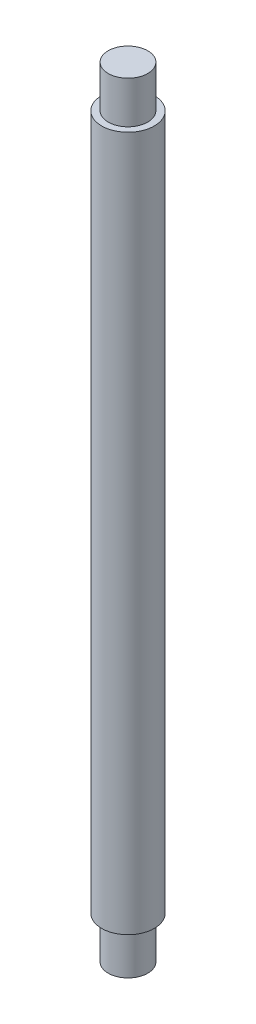
ISO-10303-21;
HEADER;
FILE_DESCRIPTION(('STEP AP214'),'2;1');
FILE_NAME('part.step','',(''),(''),'','','');
FILE_SCHEMA(('AUTOMOTIVE_DESIGN { 1 0 10303 214 1 1 1 1 }'));
ENDSEC;
DATA;
#1=APPLICATION_CONTEXT('core data for automotive mechanical design processes');
#2=APPLICATION_PROTOCOL_DEFINITION('international standard','automotive_design',2000,#1);
#3=PRODUCT_CONTEXT('',#1,'mechanical');
#4=PRODUCT('Part','Part','',(#3));
#5=PRODUCT_RELATED_PRODUCT_CATEGORY('part','',(#4));
#6=PRODUCT_DEFINITION_FORMATION('','',#4);
#7=PRODUCT_DEFINITION_CONTEXT('part definition',#1,'design');
#8=PRODUCT_DEFINITION('design','',#6,#7);
#9=PRODUCT_DEFINITION_SHAPE('','',#8);
#10=(LENGTH_UNIT() NAMED_UNIT(*) SI_UNIT(.MILLI.,.METRE.));
#11=(NAMED_UNIT(*) PLANE_ANGLE_UNIT() SI_UNIT($,.RADIAN.));
#12=(NAMED_UNIT(*) SI_UNIT($,.STERADIAN.) SOLID_ANGLE_UNIT());
#13=UNCERTAINTY_MEASURE_WITH_UNIT(LENGTH_MEASURE(1.E-05),#10,'distance_accuracy_value','');
#14=(GEOMETRIC_REPRESENTATION_CONTEXT(3) GLOBAL_UNCERTAINTY_ASSIGNED_CONTEXT((#13)) GLOBAL_UNIT_ASSIGNED_CONTEXT((#10,
#11,#12)) REPRESENTATION_CONTEXT('',''));
#15=CARTESIAN_POINT('',(0.,0.,0.));
#16=DIRECTION('',(0.,0.,1.));
#17=DIRECTION('',(1.,0.,0.));
#18=AXIS2_PLACEMENT_3D('',#15,#16,#17);
#19=CARTESIAN_POINT('',(0.,66.,0.));
#20=DIRECTION('',(0.,-1.,0.));
#21=DIRECTION('',(0.,0.,-1.));
#22=AXIS2_PLACEMENT_3D('',#19,#20,#21);
#23=CYLINDRICAL_SURFACE('',#22,2.5);
#24=CARTESIAN_POINT('',(0.,66.,0.));
#25=DIRECTION('',(0.,1.,0.));
#26=DIRECTION('',(0.,0.,1.));
#27=AXIS2_PLACEMENT_3D('',#24,#25,#26);
#28=CIRCLE('',#27,2.5);
#29=CARTESIAN_POINT('',(0.,66.,2.5));
#30=VERTEX_POINT('',#29);
#31=EDGE_CURVE('E47',#30,#30,#28,.T.);
#32=ORIENTED_EDGE('',*,*,#31,.F.);
#33=EDGE_LOOP('',(#32));
#34=FACE_BOUND('',#33,.T.);
#35=CARTESIAN_POINT('',(0.,0.,0.));
#36=DIRECTION('',(0.,1.,0.));
#37=DIRECTION('',(0.,0.,1.));
#38=AXIS2_PLACEMENT_3D('',#35,#36,#37);
#39=CIRCLE('',#38,2.5);
#40=CARTESIAN_POINT('',(0.,0.,2.5));
#41=VERTEX_POINT('',#40);
#42=EDGE_CURVE('E38',#41,#41,#39,.T.);
#43=ORIENTED_EDGE('',*,*,#42,.T.);
#44=EDGE_LOOP('',(#43));
#45=FACE_BOUND('',#44,.T.);
#46=ADVANCED_FACE('F35',(#34,#45),#23,.T.);
#47=CARTESIAN_POINT('',(0.,66.,0.));
#48=DIRECTION('',(0.,1.,0.));
#49=DIRECTION('',(0.,0.,1.));
#50=AXIS2_PLACEMENT_3D('',#47,#48,#49);
#51=PLANE('',#50);
#52=CARTESIAN_POINT('',(0.,66.,0.));
#53=DIRECTION('',(0.,1.,0.));
#54=DIRECTION('',(0.,0.,1.));
#55=AXIS2_PLACEMENT_3D('',#52,#53,#54);
#56=CIRCLE('',#55,1.875);
#57=CARTESIAN_POINT('',(0.,66.,1.875));
#58=VERTEX_POINT('',#57);
#59=EDGE_CURVE('E42',#58,#58,#56,.T.);
#60=ORIENTED_EDGE('',*,*,#59,.F.);
#61=EDGE_LOOP('',(#60));
#62=FACE_BOUND('',#61,.T.);
#63=ORIENTED_EDGE('',*,*,#31,.T.);
#64=EDGE_LOOP('',(#63));
#65=FACE_BOUND('',#64,.T.);
#66=ADVANCED_FACE('F64',(#62,#65),#51,.T.);
#67=CARTESIAN_POINT('',(0.,0.,0.));
#68=DIRECTION('',(0.,1.,0.));
#69=DIRECTION('',(0.,0.,1.));
#70=AXIS2_PLACEMENT_3D('',#67,#68,#69);
#71=PLANE('',#70);
#72=CARTESIAN_POINT('',(0.,0.,0.));
#73=DIRECTION('',(0.,-1.,0.));
#74=DIRECTION('',(0.,0.,-1.));
#75=AXIS2_PLACEMENT_3D('',#72,#73,#74);
#76=CIRCLE('',#75,1.875);
#77=CARTESIAN_POINT('',(0.,0.,-1.875));
#78=VERTEX_POINT('',#77);
#79=EDGE_CURVE('E10',#78,#78,#76,.T.);
#80=ORIENTED_EDGE('',*,*,#79,.F.);
#81=EDGE_LOOP('',(#80));
#82=FACE_BOUND('',#81,.T.);
#83=ORIENTED_EDGE('',*,*,#42,.F.);
#84=EDGE_LOOP('',(#83));
#85=FACE_BOUND('',#84,.T.);
#86=ADVANCED_FACE('F61',(#82,#85),#71,.F.);
#87=CARTESIAN_POINT('',(0.,70.,0.));
#88=DIRECTION('',(0.,-1.,0.));
#89=DIRECTION('',(0.,0.,-1.));
#90=AXIS2_PLACEMENT_3D('',#87,#88,#89);
#91=CYLINDRICAL_SURFACE('',#90,1.875);
#92=CARTESIAN_POINT('',(0.,70.,0.));
#93=DIRECTION('',(0.,1.,0.));
#94=DIRECTION('',(0.,0.,1.));
#95=AXIS2_PLACEMENT_3D('',#92,#93,#94);
#96=CIRCLE('',#95,1.875);
#97=CARTESIAN_POINT('',(0.,70.,1.875));
#98=VERTEX_POINT('',#97);
#99=EDGE_CURVE('E52',#98,#98,#96,.T.);
#100=ORIENTED_EDGE('',*,*,#99,.F.);
#101=EDGE_LOOP('',(#100));
#102=FACE_BOUND('',#101,.T.);
#103=ORIENTED_EDGE('',*,*,#59,.T.);
#104=EDGE_LOOP('',(#103));
#105=FACE_BOUND('',#104,.T.);
#106=ADVANCED_FACE('F63',(#102,#105),#91,.T.);
#107=CARTESIAN_POINT('',(0.,70.,0.));
#108=DIRECTION('',(0.,1.,0.));
#109=DIRECTION('',(0.,0.,1.));
#110=AXIS2_PLACEMENT_3D('',#107,#108,#109);
#111=PLANE('',#110);
#112=ORIENTED_EDGE('',*,*,#99,.T.);
#113=EDGE_LOOP('',(#112));
#114=FACE_BOUND('',#113,.T.);
#115=ADVANCED_FACE('F70',(#114),#111,.T.);
#116=CARTESIAN_POINT('',(0.,-4.,0.));
#117=DIRECTION('',(0.,1.,0.));
#118=DIRECTION('',(0.,0.,1.));
#119=AXIS2_PLACEMENT_3D('',#116,#117,#118);
#120=CYLINDRICAL_SURFACE('',#119,1.875);
#121=CARTESIAN_POINT('',(0.,-4.,0.));
#122=DIRECTION('',(0.,-1.,0.));
#123=DIRECTION('',(0.,0.,-1.));
#124=AXIS2_PLACEMENT_3D('',#121,#122,#123);
#125=CIRCLE('',#124,1.875);
#126=CARTESIAN_POINT('',(0.,-4.,-1.875));
#127=VERTEX_POINT('',#126);
#128=EDGE_CURVE('E51',#127,#127,#125,.T.);
#129=ORIENTED_EDGE('',*,*,#128,.F.);
#130=EDGE_LOOP('',(#129));
#131=FACE_BOUND('',#130,.T.);
#132=ORIENTED_EDGE('',*,*,#79,.T.);
#133=EDGE_LOOP('',(#132));
#134=FACE_BOUND('',#133,.T.);
#135=ADVANCED_FACE('F100',(#131,#134),#120,.T.);
#136=CARTESIAN_POINT('',(0.,-4.,0.));
#137=DIRECTION('',(0.,-1.,0.));
#138=DIRECTION('',(0.,0.,-1.));
#139=AXIS2_PLACEMENT_3D('',#136,#137,#138);
#140=PLANE('',#139);
#141=ORIENTED_EDGE('',*,*,#128,.T.);
#142=EDGE_LOOP('',(#141));
#143=FACE_BOUND('',#142,.T.);
#144=ADVANCED_FACE('F116',(#143),#140,.T.);
#145=CLOSED_SHELL('',(#46,#66,#86,#106,#115,#135,#144));
#146=MANIFOLD_SOLID_BREP('B2',#145);
#147=ADVANCED_BREP_SHAPE_REPRESENTATION('',(#18,#146),#14);
#148=SHAPE_DEFINITION_REPRESENTATION(#9,#147);
ENDSEC;
END-ISO-10303-21;
